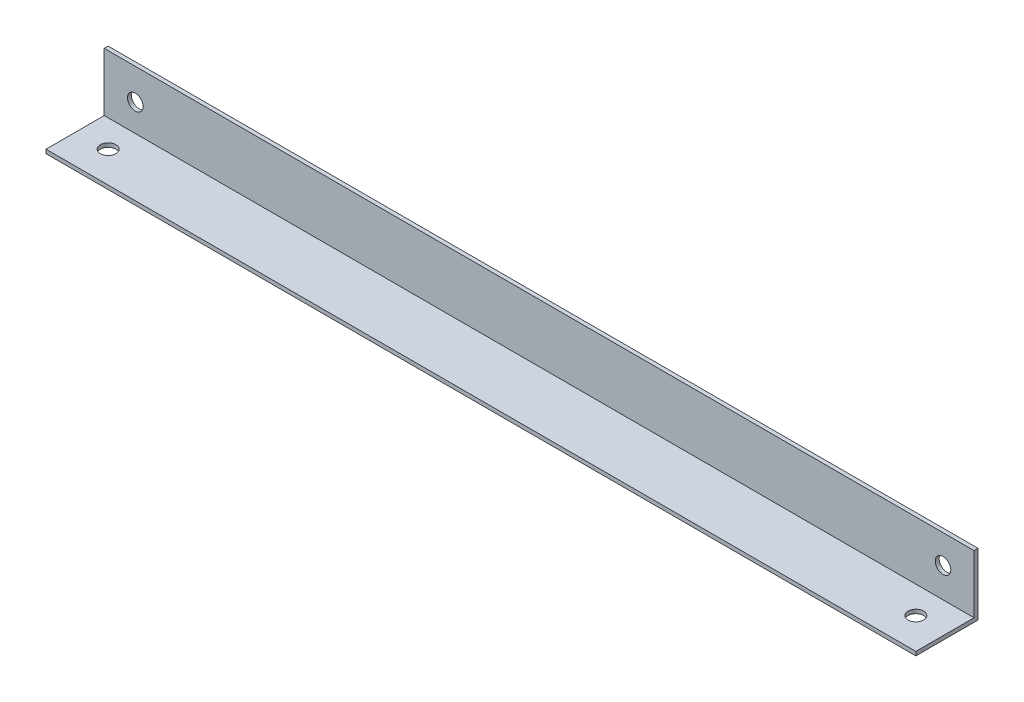
ISO-10303-21;
HEADER;
FILE_DESCRIPTION(('STEP AP214'),'2;1');
FILE_NAME('part.step','',(''),(''),'','','');
FILE_SCHEMA(('AUTOMOTIVE_DESIGN { 1 0 10303 214 1 1 1 1 }'));
ENDSEC;
DATA;
#1=APPLICATION_CONTEXT('core data for automotive mechanical design processes');
#2=APPLICATION_PROTOCOL_DEFINITION('international standard','automotive_design',2000,#1);
#3=PRODUCT_CONTEXT('',#1,'mechanical');
#4=PRODUCT('Part','Part','',(#3));
#5=PRODUCT_RELATED_PRODUCT_CATEGORY('part','',(#4));
#6=PRODUCT_DEFINITION_FORMATION('','',#4);
#7=PRODUCT_DEFINITION_CONTEXT('part definition',#1,'design');
#8=PRODUCT_DEFINITION('design','',#6,#7);
#9=PRODUCT_DEFINITION_SHAPE('','',#8);
#10=(LENGTH_UNIT() NAMED_UNIT(*) SI_UNIT(.MILLI.,.METRE.));
#11=(NAMED_UNIT(*) PLANE_ANGLE_UNIT() SI_UNIT($,.RADIAN.));
#12=(NAMED_UNIT(*) SI_UNIT($,.STERADIAN.) SOLID_ANGLE_UNIT());
#13=UNCERTAINTY_MEASURE_WITH_UNIT(LENGTH_MEASURE(1.E-05),#10,'distance_accuracy_value','');
#14=(GEOMETRIC_REPRESENTATION_CONTEXT(3) GLOBAL_UNCERTAINTY_ASSIGNED_CONTEXT((#13)) GLOBAL_UNIT_ASSIGNED_CONTEXT((#10,
#11,#12)) REPRESENTATION_CONTEXT('',''));
#15=CARTESIAN_POINT('',(0.,0.,0.));
#16=DIRECTION('',(0.,0.,1.));
#17=DIRECTION('',(1.,0.,0.));
#18=AXIS2_PLACEMENT_3D('',#15,#16,#17);
#19=CARTESIAN_POINT('',(355.6,0.,25.4));
#20=DIRECTION('',(0.,0.,1.));
#21=DIRECTION('',(1.,0.,0.));
#22=AXIS2_PLACEMENT_3D('',#19,#20,#21);
#23=PLANE('',#22);
#24=DIRECTION('',(0.,1.,0.));
#25=VECTOR('',#24,1.);
#26=CARTESIAN_POINT('',(0.,0.,25.4));
#27=LINE('',#26,#25);
#28=CARTESIAN_POINT('',(0.,1.6002,25.4));
#29=VERTEX_POINT('',#28);
#30=CARTESIAN_POINT('',(0.,0.,25.4));
#31=VERTEX_POINT('',#30);
#32=EDGE_CURVE('E107',#29,#31,#27,.F.);
#33=ORIENTED_EDGE('',*,*,#32,.T.);
#34=DIRECTION('',(1.,0.,0.));
#35=VECTOR('',#34,1.);
#36=CARTESIAN_POINT('',(0.,0.,25.4));
#37=LINE('',#36,#35);
#38=CARTESIAN_POINT('',(355.6,0.,25.4));
#39=VERTEX_POINT('',#38);
#40=EDGE_CURVE('E84',#39,#31,#37,.F.);
#41=ORIENTED_EDGE('',*,*,#40,.F.);
#42=DIRECTION('',(0.,1.,0.));
#43=VECTOR('',#42,1.);
#44=CARTESIAN_POINT('',(355.6,0.,25.4));
#45=LINE('',#44,#43);
#46=CARTESIAN_POINT('',(355.6,1.6002,25.4));
#47=VERTEX_POINT('',#46);
#48=EDGE_CURVE('E68',#39,#47,#45,.T.);
#49=ORIENTED_EDGE('',*,*,#48,.T.);
#50=DIRECTION('',(1.,0.,0.));
#51=VECTOR('',#50,1.);
#52=CARTESIAN_POINT('',(0.,1.6002,25.4));
#53=LINE('',#52,#51);
#54=EDGE_CURVE('E96',#47,#29,#53,.F.);
#55=ORIENTED_EDGE('',*,*,#54,.T.);
#56=EDGE_LOOP('',(#33,#41,#49,#55));
#57=FACE_BOUND('',#56,.T.);
#58=ADVANCED_FACE('F17',(#57),#23,.T.);
#59=CARTESIAN_POINT('',(12.7,1.6002,12.7));
#60=DIRECTION('',(0.,-1.,0.));
#61=DIRECTION('',(0.,0.,-1.));
#62=AXIS2_PLACEMENT_3D('',#59,#60,#61);
#63=CYLINDRICAL_SURFACE('',#62,3.175);
#64=CARTESIAN_POINT('',(12.7,1.6002,12.7));
#65=DIRECTION('',(0.,-1.,0.));
#66=DIRECTION('',(0.,0.,-1.));
#67=AXIS2_PLACEMENT_3D('',#64,#65,#66);
#68=CIRCLE('',#67,3.175);
#69=CARTESIAN_POINT('',(12.7,1.6002,9.525));
#70=VERTEX_POINT('',#69);
#71=EDGE_CURVE('E20',#70,#70,#68,.F.);
#72=ORIENTED_EDGE('',*,*,#71,.T.);
#73=EDGE_LOOP('',(#72));
#74=FACE_BOUND('',#73,.T.);
#75=CARTESIAN_POINT('',(12.7,0.,12.7));
#76=DIRECTION('',(0.,-1.,0.));
#77=DIRECTION('',(0.,0.,-1.));
#78=AXIS2_PLACEMENT_3D('',#75,#76,#77);
#79=CIRCLE('',#78,3.175);
#80=CARTESIAN_POINT('',(12.7,0.,9.525));
#81=VERTEX_POINT('',#80);
#82=EDGE_CURVE('E104',#81,#81,#79,.F.);
#83=ORIENTED_EDGE('',*,*,#82,.F.);
#84=EDGE_LOOP('',(#83));
#85=FACE_BOUND('',#84,.T.);
#86=ADVANCED_FACE('F129',(#74,#85),#63,.F.);
#87=CARTESIAN_POINT('',(342.9,1.6002,12.7));
#88=DIRECTION('',(0.,-1.,0.));
#89=DIRECTION('',(0.,0.,-1.));
#90=AXIS2_PLACEMENT_3D('',#87,#88,#89);
#91=CYLINDRICAL_SURFACE('',#90,3.175);
#92=CARTESIAN_POINT('',(342.9,1.6002,12.7));
#93=DIRECTION('',(0.,-1.,0.));
#94=DIRECTION('',(0.,0.,-1.));
#95=AXIS2_PLACEMENT_3D('',#92,#93,#94);
#96=CIRCLE('',#95,3.175);
#97=CARTESIAN_POINT('',(342.9,1.6002,9.525));
#98=VERTEX_POINT('',#97);
#99=EDGE_CURVE('E85',#98,#98,#96,.F.);
#100=ORIENTED_EDGE('',*,*,#99,.T.);
#101=EDGE_LOOP('',(#100));
#102=FACE_BOUND('',#101,.T.);
#103=CARTESIAN_POINT('',(342.9,0.,12.7));
#104=DIRECTION('',(0.,-1.,0.));
#105=DIRECTION('',(0.,0.,-1.));
#106=AXIS2_PLACEMENT_3D('',#103,#104,#105);
#107=CIRCLE('',#106,3.175);
#108=CARTESIAN_POINT('',(342.9,0.,9.525));
#109=VERTEX_POINT('',#108);
#110=EDGE_CURVE('E93',#109,#109,#107,.F.);
#111=ORIENTED_EDGE('',*,*,#110,.F.);
#112=EDGE_LOOP('',(#111));
#113=FACE_BOUND('',#112,.T.);
#114=ADVANCED_FACE('F133',(#102,#113),#91,.F.);
#115=CARTESIAN_POINT('',(0.,1.6002,0.));
#116=DIRECTION('',(0.,-1.,0.));
#117=DIRECTION('',(0.,0.,-1.));
#118=AXIS2_PLACEMENT_3D('',#115,#116,#117);
#119=PLANE('',#118);
#120=ORIENTED_EDGE('',*,*,#99,.F.);
#121=EDGE_LOOP('',(#120));
#122=FACE_BOUND('',#121,.T.);
#123=ORIENTED_EDGE('',*,*,#71,.F.);
#124=EDGE_LOOP('',(#123));
#125=FACE_BOUND('',#124,.T.);
#126=ORIENTED_EDGE('',*,*,#54,.F.);
#127=DIRECTION('',(0.,0.,-1.));
#128=VECTOR('',#127,1.);
#129=CARTESIAN_POINT('',(355.6,1.6002,0.));
#130=LINE('',#129,#128);
#131=CARTESIAN_POINT('',(355.6,1.6002,1.6002));
#132=VERTEX_POINT('',#131);
#133=EDGE_CURVE('E90',#132,#47,#130,.F.);
#134=ORIENTED_EDGE('',*,*,#133,.F.);
#135=DIRECTION('',(1.,0.,0.));
#136=VECTOR('',#135,1.);
#137=CARTESIAN_POINT('',(0.,1.6002,1.6002));
#138=LINE('',#137,#136);
#139=CARTESIAN_POINT('',(0.,1.6002,1.6002));
#140=VERTEX_POINT('',#139);
#141=EDGE_CURVE('E75',#140,#132,#138,.T.);
#142=ORIENTED_EDGE('',*,*,#141,.F.);
#143=DIRECTION('',(0.,0.,1.));
#144=VECTOR('',#143,1.);
#145=CARTESIAN_POINT('',(0.,1.6002,0.));
#146=LINE('',#145,#144);
#147=EDGE_CURVE('E184',#29,#140,#146,.F.);
#148=ORIENTED_EDGE('',*,*,#147,.F.);
#149=EDGE_LOOP('',(#126,#134,#142,#148));
#150=FACE_BOUND('',#149,.T.);
#151=ADVANCED_FACE('F95',(#122,#125,#150),#119,.F.);
#152=CARTESIAN_POINT('',(0.,0.,1.6002));
#153=DIRECTION('',(0.,0.,1.));
#154=DIRECTION('',(1.,0.,0.));
#155=AXIS2_PLACEMENT_3D('',#152,#153,#154);
#156=PLANE('',#155);
#157=CARTESIAN_POINT('',(342.9,13.7668,1.6002));
#158=DIRECTION('',(0.,0.,-1.));
#159=DIRECTION('',(-1.,0.,0.));
#160=AXIS2_PLACEMENT_3D('',#157,#158,#159);
#161=CIRCLE('',#160,3.175);
#162=CARTESIAN_POINT('',(339.725,13.7668,1.6002));
#163=VERTEX_POINT('',#162);
#164=EDGE_CURVE('E113',#163,#163,#161,.T.);
#165=ORIENTED_EDGE('',*,*,#164,.T.);
#166=EDGE_LOOP('',(#165));
#167=FACE_BOUND('',#166,.T.);
#168=CARTESIAN_POINT('',(12.7,12.7,1.6002));
#169=DIRECTION('',(0.,0.,-1.));
#170=DIRECTION('',(-1.,0.,0.));
#171=AXIS2_PLACEMENT_3D('',#168,#169,#170);
#172=CIRCLE('',#171,3.175);
#173=CARTESIAN_POINT('',(9.525,12.7,1.6002));
#174=VERTEX_POINT('',#173);
#175=EDGE_CURVE('E117',#174,#174,#172,.T.);
#176=ORIENTED_EDGE('',*,*,#175,.T.);
#177=EDGE_LOOP('',(#176));
#178=FACE_BOUND('',#177,.T.);
#179=DIRECTION('',(0.,1.,0.));
#180=VECTOR('',#179,1.);
#181=CARTESIAN_POINT('',(0.,25.4,1.6002));
#182=LINE('',#181,#180);
#183=CARTESIAN_POINT('',(0.,25.4,1.6002));
#184=VERTEX_POINT('',#183);
#185=EDGE_CURVE('E80',#140,#184,#182,.T.);
#186=ORIENTED_EDGE('',*,*,#185,.F.);
#187=ORIENTED_EDGE('',*,*,#141,.T.);
#188=DIRECTION('',(0.,1.,0.));
#189=VECTOR('',#188,1.);
#190=CARTESIAN_POINT('',(355.6,0.,1.6002));
#191=LINE('',#190,#189);
#192=CARTESIAN_POINT('',(355.6,25.4,1.6002));
#193=VERTEX_POINT('',#192);
#194=EDGE_CURVE('E78',#193,#132,#191,.F.);
#195=ORIENTED_EDGE('',*,*,#194,.F.);
#196=DIRECTION('',(1.,0.,0.));
#197=VECTOR('',#196,1.);
#198=CARTESIAN_POINT('',(355.6,25.4,1.6002));
#199=LINE('',#198,#197);
#200=EDGE_CURVE('E99',#184,#193,#199,.T.);
#201=ORIENTED_EDGE('',*,*,#200,.F.);
#202=EDGE_LOOP('',(#186,#187,#195,#201));
#203=FACE_BOUND('',#202,.T.);
#204=ADVANCED_FACE('F77',(#167,#178,#203),#156,.T.);
#205=CARTESIAN_POINT('',(0.,0.,0.));
#206=DIRECTION('',(0.,-1.,0.));
#207=DIRECTION('',(0.,0.,-1.));
#208=AXIS2_PLACEMENT_3D('',#205,#206,#207);
#209=PLANE('',#208);
#210=ORIENTED_EDGE('',*,*,#110,.T.);
#211=EDGE_LOOP('',(#210));
#212=FACE_BOUND('',#211,.T.);
#213=ORIENTED_EDGE('',*,*,#82,.T.);
#214=EDGE_LOOP('',(#213));
#215=FACE_BOUND('',#214,.T.);
#216=ORIENTED_EDGE('',*,*,#40,.T.);
#217=DIRECTION('',(0.,0.,1.));
#218=VECTOR('',#217,1.);
#219=CARTESIAN_POINT('',(0.,0.,0.));
#220=LINE('',#219,#218);
#221=CARTESIAN_POINT('',(0.,0.,0.));
#222=VERTEX_POINT('',#221);
#223=EDGE_CURVE('E183',#222,#31,#220,.T.);
#224=ORIENTED_EDGE('',*,*,#223,.F.);
#225=DIRECTION('',(1.,0.,0.));
#226=VECTOR('',#225,1.);
#227=CARTESIAN_POINT('',(0.,0.,0.));
#228=LINE('',#227,#226);
#229=CARTESIAN_POINT('',(355.6,0.,0.));
#230=VERTEX_POINT('',#229);
#231=EDGE_CURVE('E116',#222,#230,#228,.T.);
#232=ORIENTED_EDGE('',*,*,#231,.T.);
#233=DIRECTION('',(0.,0.,-1.));
#234=VECTOR('',#233,1.);
#235=CARTESIAN_POINT('',(355.6,0.,0.));
#236=LINE('',#235,#234);
#237=EDGE_CURVE('E97',#39,#230,#236,.T.);
#238=ORIENTED_EDGE('',*,*,#237,.F.);
#239=EDGE_LOOP('',(#216,#224,#232,#238));
#240=FACE_BOUND('',#239,.T.);
#241=ADVANCED_FACE('F141',(#212,#215,#240),#209,.T.);
#242=CARTESIAN_POINT('',(355.6,0.,0.));
#243=DIRECTION('',(1.,0.,0.));
#244=DIRECTION('',(0.,0.,-1.));
#245=AXIS2_PLACEMENT_3D('',#242,#243,#244);
#246=PLANE('',#245);
#247=ORIENTED_EDGE('',*,*,#48,.F.);
#248=ORIENTED_EDGE('',*,*,#237,.T.);
#249=DIRECTION('',(0.,1.,0.));
#250=VECTOR('',#249,1.);
#251=CARTESIAN_POINT('',(355.6,0.,0.));
#252=LINE('',#251,#250);
#253=CARTESIAN_POINT('',(355.6,25.4,0.));
#254=VERTEX_POINT('',#253);
#255=EDGE_CURVE('E194',#230,#254,#252,.T.);
#256=ORIENTED_EDGE('',*,*,#255,.T.);
#257=DIRECTION('',(0.,0.,1.));
#258=VECTOR('',#257,1.);
#259=CARTESIAN_POINT('',(355.6,25.4,0.));
#260=LINE('',#259,#258);
#261=EDGE_CURVE('E92',#193,#254,#260,.F.);
#262=ORIENTED_EDGE('',*,*,#261,.F.);
#263=ORIENTED_EDGE('',*,*,#194,.T.);
#264=ORIENTED_EDGE('',*,*,#133,.T.);
#265=EDGE_LOOP('',(#247,#248,#256,#262,#263,#264));
#266=FACE_BOUND('',#265,.T.);
#267=ADVANCED_FACE('F89',(#266),#246,.T.);
#268=CARTESIAN_POINT('',(355.6,25.4,0.));
#269=DIRECTION('',(0.,1.,0.));
#270=DIRECTION('',(0.,0.,1.));
#271=AXIS2_PLACEMENT_3D('',#268,#269,#270);
#272=PLANE('',#271);
#273=ORIENTED_EDGE('',*,*,#261,.T.);
#274=DIRECTION('',(1.,0.,0.));
#275=VECTOR('',#274,1.);
#276=CARTESIAN_POINT('',(0.,25.4,0.));
#277=LINE('',#276,#275);
#278=CARTESIAN_POINT('',(0.,25.4,0.));
#279=VERTEX_POINT('',#278);
#280=EDGE_CURVE('E196',#254,#279,#277,.F.);
#281=ORIENTED_EDGE('',*,*,#280,.T.);
#282=DIRECTION('',(0.,0.,1.));
#283=VECTOR('',#282,1.);
#284=CARTESIAN_POINT('',(0.,25.4,0.));
#285=LINE('',#284,#283);
#286=EDGE_CURVE('E35',#184,#279,#285,.F.);
#287=ORIENTED_EDGE('',*,*,#286,.F.);
#288=ORIENTED_EDGE('',*,*,#200,.T.);
#289=EDGE_LOOP('',(#273,#281,#287,#288));
#290=FACE_BOUND('',#289,.T.);
#291=ADVANCED_FACE('F165',(#290),#272,.T.);
#292=CARTESIAN_POINT('',(0.,25.4,0.));
#293=DIRECTION('',(-1.,0.,0.));
#294=DIRECTION('',(0.,0.,1.));
#295=AXIS2_PLACEMENT_3D('',#292,#293,#294);
#296=PLANE('',#295);
#297=ORIENTED_EDGE('',*,*,#147,.T.);
#298=ORIENTED_EDGE('',*,*,#185,.T.);
#299=ORIENTED_EDGE('',*,*,#286,.T.);
#300=DIRECTION('',(0.,1.,0.));
#301=VECTOR('',#300,1.);
#302=CARTESIAN_POINT('',(0.,0.,0.));
#303=LINE('',#302,#301);
#304=EDGE_CURVE('E112',#279,#222,#303,.F.);
#305=ORIENTED_EDGE('',*,*,#304,.T.);
#306=ORIENTED_EDGE('',*,*,#223,.T.);
#307=ORIENTED_EDGE('',*,*,#32,.F.);
#308=EDGE_LOOP('',(#297,#298,#299,#305,#306,#307));
#309=FACE_BOUND('',#308,.T.);
#310=ADVANCED_FACE('F161',(#309),#296,.T.);
#311=CARTESIAN_POINT('',(12.7,12.7,1.6002));
#312=DIRECTION('',(0.,0.,-1.));
#313=DIRECTION('',(-1.,0.,0.));
#314=AXIS2_PLACEMENT_3D('',#311,#312,#313);
#315=CYLINDRICAL_SURFACE('',#314,3.175);
#316=ORIENTED_EDGE('',*,*,#175,.F.);
#317=EDGE_LOOP('',(#316));
#318=FACE_BOUND('',#317,.T.);
#319=CARTESIAN_POINT('',(12.7,12.7,0.));
#320=DIRECTION('',(0.,0.,-1.));
#321=DIRECTION('',(-1.,0.,0.));
#322=AXIS2_PLACEMENT_3D('',#319,#320,#321);
#323=CIRCLE('',#322,3.175);
#324=CARTESIAN_POINT('',(9.525,12.7,0.));
#325=VERTEX_POINT('',#324);
#326=EDGE_CURVE('E26',#325,#325,#323,.T.);
#327=ORIENTED_EDGE('',*,*,#326,.T.);
#328=EDGE_LOOP('',(#327));
#329=FACE_BOUND('',#328,.T.);
#330=ADVANCED_FACE('F153',(#318,#329),#315,.F.);
#331=CARTESIAN_POINT('',(342.9,13.7668,1.6002));
#332=DIRECTION('',(0.,0.,-1.));
#333=DIRECTION('',(-1.,0.,0.));
#334=AXIS2_PLACEMENT_3D('',#331,#332,#333);
#335=CYLINDRICAL_SURFACE('',#334,3.175);
#336=ORIENTED_EDGE('',*,*,#164,.F.);
#337=EDGE_LOOP('',(#336));
#338=FACE_BOUND('',#337,.T.);
#339=CARTESIAN_POINT('',(342.9,13.7668,0.));
#340=DIRECTION('',(0.,0.,-1.));
#341=DIRECTION('',(-1.,0.,0.));
#342=AXIS2_PLACEMENT_3D('',#339,#340,#341);
#343=CIRCLE('',#342,3.175);
#344=CARTESIAN_POINT('',(339.725,13.7668,0.));
#345=VERTEX_POINT('',#344);
#346=EDGE_CURVE('E11',#345,#345,#343,.T.);
#347=ORIENTED_EDGE('',*,*,#346,.T.);
#348=EDGE_LOOP('',(#347));
#349=FACE_BOUND('',#348,.T.);
#350=ADVANCED_FACE('F147',(#338,#349),#335,.F.);
#351=CARTESIAN_POINT('',(0.,0.,0.));
#352=DIRECTION('',(0.,0.,1.));
#353=DIRECTION('',(1.,0.,0.));
#354=AXIS2_PLACEMENT_3D('',#351,#352,#353);
#355=PLANE('',#354);
#356=ORIENTED_EDGE('',*,*,#346,.F.);
#357=EDGE_LOOP('',(#356));
#358=FACE_BOUND('',#357,.T.);
#359=ORIENTED_EDGE('',*,*,#326,.F.);
#360=EDGE_LOOP('',(#359));
#361=FACE_BOUND('',#360,.T.);
#362=ORIENTED_EDGE('',*,*,#280,.F.);
#363=ORIENTED_EDGE('',*,*,#255,.F.);
#364=ORIENTED_EDGE('',*,*,#231,.F.);
#365=ORIENTED_EDGE('',*,*,#304,.F.);
#366=EDGE_LOOP('',(#362,#363,#364,#365));
#367=FACE_BOUND('',#366,.T.);
#368=ADVANCED_FACE('F145',(#358,#361,#367),#355,.F.);
#369=CLOSED_SHELL('',(#58,#86,#114,#151,#204,#241,#267,#291,#310,#330,#350,#368));
#370=MANIFOLD_SOLID_BREP('B1',#369);
#371=ADVANCED_BREP_SHAPE_REPRESENTATION('',(#18,#370),#14);
#372=SHAPE_DEFINITION_REPRESENTATION(#9,#371);
ENDSEC;
END-ISO-10303-21;
